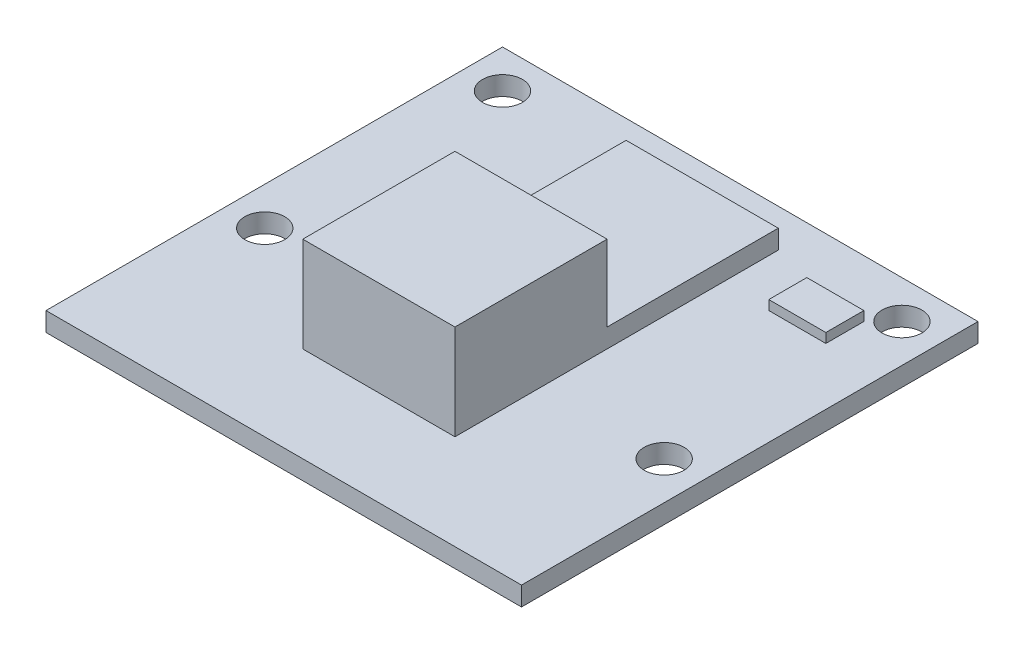
ISO-10303-21;
HEADER;
FILE_DESCRIPTION(('STEP AP214'),'2;1');
FILE_NAME('part.step','',(''),(''),'','','');
FILE_SCHEMA(('AUTOMOTIVE_DESIGN { 1 0 10303 214 1 1 1 1 }'));
ENDSEC;
DATA;
#1=APPLICATION_CONTEXT('core data for automotive mechanical design processes');
#2=APPLICATION_PROTOCOL_DEFINITION('international standard','automotive_design',2000,#1);
#3=PRODUCT_CONTEXT('',#1,'mechanical');
#4=PRODUCT('Part','Part','',(#3));
#5=PRODUCT_RELATED_PRODUCT_CATEGORY('part','',(#4));
#6=PRODUCT_DEFINITION_FORMATION('','',#4);
#7=PRODUCT_DEFINITION_CONTEXT('part definition',#1,'design');
#8=PRODUCT_DEFINITION('design','',#6,#7);
#9=PRODUCT_DEFINITION_SHAPE('','',#8);
#10=(LENGTH_UNIT() NAMED_UNIT(*) SI_UNIT(.MILLI.,.METRE.));
#11=(NAMED_UNIT(*) PLANE_ANGLE_UNIT() SI_UNIT($,.RADIAN.));
#12=(NAMED_UNIT(*) SI_UNIT($,.STERADIAN.) SOLID_ANGLE_UNIT());
#13=UNCERTAINTY_MEASURE_WITH_UNIT(LENGTH_MEASURE(1.E-05),#10,'distance_accuracy_value','');
#14=(GEOMETRIC_REPRESENTATION_CONTEXT(3) GLOBAL_UNCERTAINTY_ASSIGNED_CONTEXT((#13)) GLOBAL_UNIT_ASSIGNED_CONTEXT((#10,
#11,#12)) REPRESENTATION_CONTEXT('',''));
#15=CARTESIAN_POINT('',(0.,0.,0.));
#16=DIRECTION('',(0.,0.,1.));
#17=DIRECTION('',(1.,0.,0.));
#18=AXIS2_PLACEMENT_3D('',#15,#16,#17);
#19=CARTESIAN_POINT('',(0.,1.,0.));
#20=DIRECTION('',(0.,1.,0.));
#21=DIRECTION('',(0.,0.,1.));
#22=AXIS2_PLACEMENT_3D('',#19,#20,#21);
#23=PLANE('',#22);
#24=CARTESIAN_POINT('',(-10.5,1.,2.5));
#25=DIRECTION('',(0.,1.,0.));
#26=DIRECTION('',(0.,0.,1.));
#27=AXIS2_PLACEMENT_3D('',#24,#25,#26);
#28=CIRCLE('',#27,1.04841962507792);
#29=CARTESIAN_POINT('',(-10.5,1.,3.54841962507792));
#30=VERTEX_POINT('',#29);
#31=EDGE_CURVE('E486',#30,#30,#28,.T.);
#32=ORIENTED_EDGE('',*,*,#31,.F.);
#33=EDGE_LOOP('',(#32));
#34=FACE_BOUND('',#33,.T.);
#35=CARTESIAN_POINT('',(10.5,1.,2.5));
#36=DIRECTION('',(0.,1.,0.));
#37=DIRECTION('',(0.,0.,1.));
#38=AXIS2_PLACEMENT_3D('',#35,#36,#37);
#39=CIRCLE('',#38,1.04841962507792);
#40=CARTESIAN_POINT('',(10.5,1.,3.54841962507792));
#41=VERTEX_POINT('',#40);
#42=EDGE_CURVE('E490',#41,#41,#39,.T.);
#43=ORIENTED_EDGE('',*,*,#42,.F.);
#44=EDGE_LOOP('',(#43));
#45=FACE_BOUND('',#44,.T.);
#46=CARTESIAN_POINT('',(10.5,1.,-10.));
#47=DIRECTION('',(0.,1.,0.));
#48=DIRECTION('',(0.,0.,1.));
#49=AXIS2_PLACEMENT_3D('',#46,#47,#48);
#50=CIRCLE('',#49,1.04841962507792);
#51=CARTESIAN_POINT('',(10.5,1.,-8.95158037492208));
#52=VERTEX_POINT('',#51);
#53=EDGE_CURVE('E499',#52,#52,#50,.T.);
#54=ORIENTED_EDGE('',*,*,#53,.F.);
#55=EDGE_LOOP('',(#54));
#56=FACE_BOUND('',#55,.T.);
#57=CARTESIAN_POINT('',(-10.5,1.,-10.));
#58=DIRECTION('',(0.,1.,0.));
#59=DIRECTION('',(0.,0.,1.));
#60=AXIS2_PLACEMENT_3D('',#57,#58,#59);
#61=CIRCLE('',#60,1.04841962507792);
#62=CARTESIAN_POINT('',(-10.5,1.,-8.95158037492208));
#63=VERTEX_POINT('',#62);
#64=EDGE_CURVE('E505',#63,#63,#61,.T.);
#65=ORIENTED_EDGE('',*,*,#64,.F.);
#66=EDGE_LOOP('',(#65));
#67=FACE_BOUND('',#66,.T.);
#68=DIRECTION('',(0.,0.,1.));
#69=VECTOR('',#68,1.);
#70=CARTESIAN_POINT('',(-4.,1.,-0.999999999999997));
#71=LINE('',#70,#69);
#72=CARTESIAN_POINT('',(-4.,1.,-9.99999999999999));
#73=VERTEX_POINT('',#72);
#74=CARTESIAN_POINT('',(-4.,1.,7.));
#75=VERTEX_POINT('',#74);
#76=EDGE_CURVE('E195',#73,#75,#71,.T.);
#77=ORIENTED_EDGE('',*,*,#76,.F.);
#78=DIRECTION('',(-1.,0.,0.));
#79=VECTOR('',#78,1.);
#80=CARTESIAN_POINT('',(-4.,1.,-9.99999999999999));
#81=LINE('',#80,#79);
#82=CARTESIAN_POINT('',(4.,1.,-9.99999999999999));
#83=VERTEX_POINT('',#82);
#84=EDGE_CURVE('E161',#83,#73,#81,.T.);
#85=ORIENTED_EDGE('',*,*,#84,.F.);
#86=DIRECTION('',(0.,0.,-1.));
#87=VECTOR('',#86,1.);
#88=CARTESIAN_POINT('',(4.,1.,-0.999999999999997));
#89=LINE('',#88,#87);
#90=CARTESIAN_POINT('',(4.,1.,7.));
#91=VERTEX_POINT('',#90);
#92=EDGE_CURVE('E182',#91,#83,#89,.T.);
#93=ORIENTED_EDGE('',*,*,#92,.F.);
#94=DIRECTION('',(1.,0.,0.));
#95=VECTOR('',#94,1.);
#96=CARTESIAN_POINT('',(-4.,1.,7.));
#97=LINE('',#96,#95);
#98=EDGE_CURVE('E187',#75,#91,#97,.T.);
#99=ORIENTED_EDGE('',*,*,#98,.F.);
#100=EDGE_LOOP('',(#77,#85,#93,#99));
#101=FACE_BOUND('',#100,.T.);
#102=DIRECTION('',(0.,0.,-1.));
#103=VECTOR('',#102,1.);
#104=CARTESIAN_POINT('',(12.5,1.,-12.));
#105=LINE('',#104,#103);
#106=CARTESIAN_POINT('',(12.5,1.,12.));
#107=VERTEX_POINT('',#106);
#108=CARTESIAN_POINT('',(12.5,1.,-12.));
#109=VERTEX_POINT('',#108);
#110=EDGE_CURVE('E208',#107,#109,#105,.T.);
#111=ORIENTED_EDGE('',*,*,#110,.T.);
#112=DIRECTION('',(-1.,0.,0.));
#113=VECTOR('',#112,1.);
#114=CARTESIAN_POINT('',(-12.5,1.,-12.));
#115=LINE('',#114,#113);
#116=CARTESIAN_POINT('',(-12.5,1.,-12.));
#117=VERTEX_POINT('',#116);
#118=EDGE_CURVE('E211',#109,#117,#115,.T.);
#119=ORIENTED_EDGE('',*,*,#118,.T.);
#120=DIRECTION('',(0.,0.,1.));
#121=VECTOR('',#120,1.);
#122=CARTESIAN_POINT('',(-12.5,1.,-12.));
#123=LINE('',#122,#121);
#124=CARTESIAN_POINT('',(-12.5,1.,12.));
#125=VERTEX_POINT('',#124);
#126=EDGE_CURVE('E214',#117,#125,#123,.T.);
#127=ORIENTED_EDGE('',*,*,#126,.T.);
#128=DIRECTION('',(1.,0.,0.));
#129=VECTOR('',#128,1.);
#130=CARTESIAN_POINT('',(-12.5,1.,12.));
#131=LINE('',#130,#129);
#132=EDGE_CURVE('E216',#125,#107,#131,.T.);
#133=ORIENTED_EDGE('',*,*,#132,.T.);
#134=EDGE_LOOP('',(#111,#119,#127,#133));
#135=FACE_BOUND('',#134,.T.);
#136=DIRECTION('',(1.,0.,0.));
#137=VECTOR('',#136,1.);
#138=CARTESIAN_POINT('',(6.5,1.,-7.));
#139=LINE('',#138,#137);
#140=CARTESIAN_POINT('',(6.5,1.,-7.));
#141=VERTEX_POINT('',#140);
#142=CARTESIAN_POINT('',(9.5,1.,-7.));
#143=VERTEX_POINT('',#142);
#144=EDGE_CURVE('E515',#141,#143,#139,.T.);
#145=ORIENTED_EDGE('',*,*,#144,.F.);
#146=DIRECTION('',(0.,0.,1.));
#147=VECTOR('',#146,1.);
#148=CARTESIAN_POINT('',(6.5,1.,-9.));
#149=LINE('',#148,#147);
#150=CARTESIAN_POINT('',(6.5,1.,-9.));
#151=VERTEX_POINT('',#150);
#152=EDGE_CURVE('E159',#151,#141,#149,.T.);
#153=ORIENTED_EDGE('',*,*,#152,.F.);
#154=DIRECTION('',(-1.,0.,0.));
#155=VECTOR('',#154,1.);
#156=CARTESIAN_POINT('',(6.5,1.,-9.));
#157=LINE('',#156,#155);
#158=CARTESIAN_POINT('',(9.5,1.,-9.));
#159=VERTEX_POINT('',#158);
#160=EDGE_CURVE('E155',#159,#151,#157,.T.);
#161=ORIENTED_EDGE('',*,*,#160,.F.);
#162=DIRECTION('',(0.,0.,-1.));
#163=VECTOR('',#162,1.);
#164=CARTESIAN_POINT('',(9.5,1.,-9.));
#165=LINE('',#164,#163);
#166=EDGE_CURVE('E517',#143,#159,#165,.T.);
#167=ORIENTED_EDGE('',*,*,#166,.F.);
#168=EDGE_LOOP('',(#145,#153,#161,#167));
#169=FACE_BOUND('',#168,.T.);
#170=ADVANCED_FACE('F34',(#34,#45,#56,#67,#101,#135,#169),#23,.T.);
#171=CARTESIAN_POINT('',(-4.,6.,-0.999999999999997));
#172=DIRECTION('',(0.,0.,1.));
#173=DIRECTION('',(1.,0.,0.));
#174=AXIS2_PLACEMENT_3D('',#171,#172,#173);
#175=PLANE('',#174);
#176=DIRECTION('',(1.,0.,0.));
#177=VECTOR('',#176,1.);
#178=CARTESIAN_POINT('',(-4.,2.,-0.999999999999997));
#179=LINE('',#178,#177);
#180=CARTESIAN_POINT('',(-4.,2.,-0.999999999999997));
#181=VERTEX_POINT('',#180);
#182=CARTESIAN_POINT('',(4.,2.,-0.999999999999997));
#183=VERTEX_POINT('',#182);
#184=EDGE_CURVE('E170',#181,#183,#179,.T.);
#185=ORIENTED_EDGE('',*,*,#184,.F.);
#186=DIRECTION('',(0.,-1.,0.));
#187=VECTOR('',#186,1.);
#188=CARTESIAN_POINT('',(-4.,6.,-0.999999999999997));
#189=LINE('',#188,#187);
#190=CARTESIAN_POINT('',(-4.,6.,-0.999999999999997));
#191=VERTEX_POINT('',#190);
#192=EDGE_CURVE('E201',#191,#181,#189,.T.);
#193=ORIENTED_EDGE('',*,*,#192,.F.);
#194=DIRECTION('',(-1.,0.,0.));
#195=VECTOR('',#194,1.);
#196=CARTESIAN_POINT('',(-4.,6.,-0.999999999999997));
#197=LINE('',#196,#195);
#198=CARTESIAN_POINT('',(4.,6.,-0.999999999999997));
#199=VERTEX_POINT('',#198);
#200=EDGE_CURVE('E186',#199,#191,#197,.T.);
#201=ORIENTED_EDGE('',*,*,#200,.F.);
#202=DIRECTION('',(0.,-1.,0.));
#203=VECTOR('',#202,1.);
#204=CARTESIAN_POINT('',(4.,6.,-0.999999999999997));
#205=LINE('',#204,#203);
#206=EDGE_CURVE('E204',#199,#183,#205,.T.);
#207=ORIENTED_EDGE('',*,*,#206,.T.);
#208=EDGE_LOOP('',(#185,#193,#201,#207));
#209=FACE_BOUND('',#208,.T.);
#210=ADVANCED_FACE('F258',(#209),#175,.F.);
#211=CARTESIAN_POINT('',(12.5,1.,-12.));
#212=DIRECTION('',(-1.,0.,0.));
#213=DIRECTION('',(0.,0.,1.));
#214=AXIS2_PLACEMENT_3D('',#211,#212,#213);
#215=PLANE('',#214);
#216=DIRECTION('',(0.,0.,-1.));
#217=VECTOR('',#216,1.);
#218=CARTESIAN_POINT('',(12.5,0.,-12.));
#219=LINE('',#218,#217);
#220=CARTESIAN_POINT('',(12.5,0.,12.));
#221=VERTEX_POINT('',#220);
#222=CARTESIAN_POINT('',(12.5,0.,-12.));
#223=VERTEX_POINT('',#222);
#224=EDGE_CURVE('E207',#221,#223,#219,.T.);
#225=ORIENTED_EDGE('',*,*,#224,.T.);
#226=DIRECTION('',(0.,-1.,0.));
#227=VECTOR('',#226,1.);
#228=CARTESIAN_POINT('',(12.5,1.,-12.));
#229=LINE('',#228,#227);
#230=EDGE_CURVE('E11',#109,#223,#229,.T.);
#231=ORIENTED_EDGE('',*,*,#230,.F.);
#232=ORIENTED_EDGE('',*,*,#110,.F.);
#233=DIRECTION('',(0.,-1.,0.));
#234=VECTOR('',#233,1.);
#235=CARTESIAN_POINT('',(12.5,1.,12.));
#236=LINE('',#235,#234);
#237=EDGE_CURVE('E218',#107,#221,#236,.T.);
#238=ORIENTED_EDGE('',*,*,#237,.T.);
#239=EDGE_LOOP('',(#225,#231,#232,#238));
#240=FACE_BOUND('',#239,.T.);
#241=ADVANCED_FACE('F36',(#240),#215,.F.);
#242=CARTESIAN_POINT('',(-12.5,1.,-12.));
#243=DIRECTION('',(0.,0.,1.));
#244=DIRECTION('',(1.,0.,0.));
#245=AXIS2_PLACEMENT_3D('',#242,#243,#244);
#246=PLANE('',#245);
#247=DIRECTION('',(-1.,0.,0.));
#248=VECTOR('',#247,1.);
#249=CARTESIAN_POINT('',(-12.5,0.,-12.));
#250=LINE('',#249,#248);
#251=CARTESIAN_POINT('',(-12.5,0.,-12.));
#252=VERTEX_POINT('',#251);
#253=EDGE_CURVE('E221',#223,#252,#250,.T.);
#254=ORIENTED_EDGE('',*,*,#253,.T.);
#255=DIRECTION('',(0.,-1.,0.));
#256=VECTOR('',#255,1.);
#257=CARTESIAN_POINT('',(-12.5,1.,-12.));
#258=LINE('',#257,#256);
#259=EDGE_CURVE('E42',#117,#252,#258,.T.);
#260=ORIENTED_EDGE('',*,*,#259,.F.);
#261=ORIENTED_EDGE('',*,*,#118,.F.);
#262=ORIENTED_EDGE('',*,*,#230,.T.);
#263=EDGE_LOOP('',(#254,#260,#261,#262));
#264=FACE_BOUND('',#263,.T.);
#265=ADVANCED_FACE('F251',(#264),#246,.F.);
#266=CARTESIAN_POINT('',(-12.5,1.,-12.));
#267=DIRECTION('',(1.,0.,0.));
#268=DIRECTION('',(0.,0.,-1.));
#269=AXIS2_PLACEMENT_3D('',#266,#267,#268);
#270=PLANE('',#269);
#271=DIRECTION('',(0.,0.,1.));
#272=VECTOR('',#271,1.);
#273=CARTESIAN_POINT('',(-12.5,0.,-12.));
#274=LINE('',#273,#272);
#275=CARTESIAN_POINT('',(-12.5,0.,12.));
#276=VERTEX_POINT('',#275);
#277=EDGE_CURVE('E223',#252,#276,#274,.T.);
#278=ORIENTED_EDGE('',*,*,#277,.T.);
#279=DIRECTION('',(0.,-1.,0.));
#280=VECTOR('',#279,1.);
#281=CARTESIAN_POINT('',(-12.5,1.,12.));
#282=LINE('',#281,#280);
#283=EDGE_CURVE('E228',#125,#276,#282,.T.);
#284=ORIENTED_EDGE('',*,*,#283,.F.);
#285=ORIENTED_EDGE('',*,*,#126,.F.);
#286=ORIENTED_EDGE('',*,*,#259,.T.);
#287=EDGE_LOOP('',(#278,#284,#285,#286));
#288=FACE_BOUND('',#287,.T.);
#289=ADVANCED_FACE('F235',(#288),#270,.F.);
#290=CARTESIAN_POINT('',(-12.5,1.,12.));
#291=DIRECTION('',(0.,0.,-1.));
#292=DIRECTION('',(-1.,0.,0.));
#293=AXIS2_PLACEMENT_3D('',#290,#291,#292);
#294=PLANE('',#293);
#295=DIRECTION('',(1.,0.,0.));
#296=VECTOR('',#295,1.);
#297=CARTESIAN_POINT('',(-12.5,0.,12.));
#298=LINE('',#297,#296);
#299=EDGE_CURVE('E212',#276,#221,#298,.T.);
#300=ORIENTED_EDGE('',*,*,#299,.T.);
#301=ORIENTED_EDGE('',*,*,#237,.F.);
#302=ORIENTED_EDGE('',*,*,#132,.F.);
#303=ORIENTED_EDGE('',*,*,#283,.T.);
#304=EDGE_LOOP('',(#300,#301,#302,#303));
#305=FACE_BOUND('',#304,.T.);
#306=ADVANCED_FACE('F244',(#305),#294,.F.);
#307=CARTESIAN_POINT('',(0.,0.,0.));
#308=DIRECTION('',(0.,1.,0.));
#309=DIRECTION('',(0.,0.,1.));
#310=AXIS2_PLACEMENT_3D('',#307,#308,#309);
#311=PLANE('',#310);
#312=CARTESIAN_POINT('',(-10.5,0.,2.5));
#313=DIRECTION('',(0.,1.,0.));
#314=DIRECTION('',(0.,0.,1.));
#315=AXIS2_PLACEMENT_3D('',#312,#313,#314);
#316=CIRCLE('',#315,1.04841962507792);
#317=CARTESIAN_POINT('',(-10.5,0.,3.54841962507792));
#318=VERTEX_POINT('',#317);
#319=EDGE_CURVE('E489',#318,#318,#316,.F.);
#320=ORIENTED_EDGE('',*,*,#319,.F.);
#321=EDGE_LOOP('',(#320));
#322=FACE_BOUND('',#321,.T.);
#323=CARTESIAN_POINT('',(10.5,0.,2.5));
#324=DIRECTION('',(0.,1.,0.));
#325=DIRECTION('',(0.,0.,1.));
#326=AXIS2_PLACEMENT_3D('',#323,#324,#325);
#327=CIRCLE('',#326,1.04841962507792);
#328=CARTESIAN_POINT('',(10.5,0.,3.54841962507792));
#329=VERTEX_POINT('',#328);
#330=EDGE_CURVE('E493',#329,#329,#327,.F.);
#331=ORIENTED_EDGE('',*,*,#330,.F.);
#332=EDGE_LOOP('',(#331));
#333=FACE_BOUND('',#332,.T.);
#334=CARTESIAN_POINT('',(10.5,0.,-10.));
#335=DIRECTION('',(0.,1.,0.));
#336=DIRECTION('',(0.,0.,1.));
#337=AXIS2_PLACEMENT_3D('',#334,#335,#336);
#338=CIRCLE('',#337,1.04841962507792);
#339=CARTESIAN_POINT('',(10.5,0.,-8.95158037492208));
#340=VERTEX_POINT('',#339);
#341=EDGE_CURVE('E502',#340,#340,#338,.F.);
#342=ORIENTED_EDGE('',*,*,#341,.F.);
#343=EDGE_LOOP('',(#342));
#344=FACE_BOUND('',#343,.T.);
#345=CARTESIAN_POINT('',(-10.5,0.,-10.));
#346=DIRECTION('',(0.,1.,0.));
#347=DIRECTION('',(0.,0.,1.));
#348=AXIS2_PLACEMENT_3D('',#345,#346,#347);
#349=CIRCLE('',#348,1.04841962507792);
#350=CARTESIAN_POINT('',(-10.5,0.,-8.95158037492208));
#351=VERTEX_POINT('',#350);
#352=EDGE_CURVE('E508',#351,#351,#349,.F.);
#353=ORIENTED_EDGE('',*,*,#352,.F.);
#354=EDGE_LOOP('',(#353));
#355=FACE_BOUND('',#354,.T.);
#356=ORIENTED_EDGE('',*,*,#224,.F.);
#357=ORIENTED_EDGE('',*,*,#299,.F.);
#358=ORIENTED_EDGE('',*,*,#277,.F.);
#359=ORIENTED_EDGE('',*,*,#253,.F.);
#360=EDGE_LOOP('',(#356,#357,#358,#359));
#361=FACE_BOUND('',#360,.T.);
#362=ADVANCED_FACE('F241',(#322,#333,#344,#355,#361),#311,.F.);
#363=CARTESIAN_POINT('',(4.,6.,-0.999999999999997));
#364=DIRECTION('',(-1.,0.,0.));
#365=DIRECTION('',(0.,0.,1.));
#366=AXIS2_PLACEMENT_3D('',#363,#364,#365);
#367=PLANE('',#366);
#368=ORIENTED_EDGE('',*,*,#92,.T.);
#369=DIRECTION('',(0.,-1.,0.));
#370=VECTOR('',#369,1.);
#371=CARTESIAN_POINT('',(4.,2.,-9.99999999999999));
#372=LINE('',#371,#370);
#373=CARTESIAN_POINT('',(4.,2.,-9.99999999999999));
#374=VERTEX_POINT('',#373);
#375=EDGE_CURVE('E179',#374,#83,#372,.T.);
#376=ORIENTED_EDGE('',*,*,#375,.F.);
#377=DIRECTION('',(0.,0.,-1.));
#378=VECTOR('',#377,1.);
#379=CARTESIAN_POINT('',(4.,2.,-0.999999999999997));
#380=LINE('',#379,#378);
#381=EDGE_CURVE('E172',#183,#374,#380,.T.);
#382=ORIENTED_EDGE('',*,*,#381,.F.);
#383=ORIENTED_EDGE('',*,*,#206,.F.);
#384=DIRECTION('',(0.,0.,-1.));
#385=VECTOR('',#384,1.);
#386=CARTESIAN_POINT('',(4.,6.,-0.999999999999997));
#387=LINE('',#386,#385);
#388=CARTESIAN_POINT('',(4.,6.,7.));
#389=VERTEX_POINT('',#388);
#390=EDGE_CURVE('E183',#389,#199,#387,.T.);
#391=ORIENTED_EDGE('',*,*,#390,.F.);
#392=DIRECTION('',(0.,-1.,0.));
#393=VECTOR('',#392,1.);
#394=CARTESIAN_POINT('',(4.,6.,7.));
#395=LINE('',#394,#393);
#396=EDGE_CURVE('E193',#389,#91,#395,.T.);
#397=ORIENTED_EDGE('',*,*,#396,.T.);
#398=EDGE_LOOP('',(#368,#376,#382,#383,#391,#397));
#399=FACE_BOUND('',#398,.T.);
#400=ADVANCED_FACE('F271',(#399),#367,.F.);
#401=CARTESIAN_POINT('',(-4.,6.,-0.999999999999997));
#402=DIRECTION('',(1.,0.,0.));
#403=DIRECTION('',(0.,0.,-1.));
#404=AXIS2_PLACEMENT_3D('',#401,#402,#403);
#405=PLANE('',#404);
#406=ORIENTED_EDGE('',*,*,#76,.T.);
#407=DIRECTION('',(0.,-1.,0.));
#408=VECTOR('',#407,1.);
#409=CARTESIAN_POINT('',(-4.,6.,7.));
#410=LINE('',#409,#408);
#411=CARTESIAN_POINT('',(-4.,6.,7.));
#412=VERTEX_POINT('',#411);
#413=EDGE_CURVE('E57',#412,#75,#410,.T.);
#414=ORIENTED_EDGE('',*,*,#413,.F.);
#415=DIRECTION('',(0.,0.,1.));
#416=VECTOR('',#415,1.);
#417=CARTESIAN_POINT('',(-4.,6.,-0.999999999999997));
#418=LINE('',#417,#416);
#419=EDGE_CURVE('E189',#191,#412,#418,.T.);
#420=ORIENTED_EDGE('',*,*,#419,.F.);
#421=ORIENTED_EDGE('',*,*,#192,.T.);
#422=DIRECTION('',(0.,0.,1.));
#423=VECTOR('',#422,1.);
#424=CARTESIAN_POINT('',(-4.,2.,-0.999999999999997));
#425=LINE('',#424,#423);
#426=CARTESIAN_POINT('',(-4.,2.,-9.99999999999999));
#427=VERTEX_POINT('',#426);
#428=EDGE_CURVE('E164',#427,#181,#425,.T.);
#429=ORIENTED_EDGE('',*,*,#428,.F.);
#430=DIRECTION('',(0.,-1.,0.));
#431=VECTOR('',#430,1.);
#432=CARTESIAN_POINT('',(-4.,2.,-9.99999999999999));
#433=LINE('',#432,#431);
#434=EDGE_CURVE('E175',#427,#73,#433,.T.);
#435=ORIENTED_EDGE('',*,*,#434,.T.);
#436=EDGE_LOOP('',(#406,#414,#420,#421,#429,#435));
#437=FACE_BOUND('',#436,.T.);
#438=ADVANCED_FACE('F292',(#437),#405,.F.);
#439=CARTESIAN_POINT('',(-4.,6.,7.));
#440=DIRECTION('',(0.,0.,-1.));
#441=DIRECTION('',(-1.,0.,0.));
#442=AXIS2_PLACEMENT_3D('',#439,#440,#441);
#443=PLANE('',#442);
#444=ORIENTED_EDGE('',*,*,#98,.T.);
#445=ORIENTED_EDGE('',*,*,#396,.F.);
#446=DIRECTION('',(1.,0.,0.));
#447=VECTOR('',#446,1.);
#448=CARTESIAN_POINT('',(-4.,6.,7.));
#449=LINE('',#448,#447);
#450=EDGE_CURVE('E191',#412,#389,#449,.T.);
#451=ORIENTED_EDGE('',*,*,#450,.F.);
#452=ORIENTED_EDGE('',*,*,#413,.T.);
#453=EDGE_LOOP('',(#444,#445,#451,#452));
#454=FACE_BOUND('',#453,.T.);
#455=ADVANCED_FACE('F300',(#454),#443,.F.);
#456=CARTESIAN_POINT('',(0.,6.,0.));
#457=DIRECTION('',(0.,1.,0.));
#458=DIRECTION('',(0.,0.,1.));
#459=AXIS2_PLACEMENT_3D('',#456,#457,#458);
#460=PLANE('',#459);
#461=ORIENTED_EDGE('',*,*,#390,.T.);
#462=ORIENTED_EDGE('',*,*,#200,.T.);
#463=ORIENTED_EDGE('',*,*,#419,.T.);
#464=ORIENTED_EDGE('',*,*,#450,.T.);
#465=EDGE_LOOP('',(#461,#462,#463,#464));
#466=FACE_BOUND('',#465,.T.);
#467=ADVANCED_FACE('F309',(#466),#460,.T.);
#468=CARTESIAN_POINT('',(-4.,2.,-9.99999999999999));
#469=DIRECTION('',(0.,0.,1.));
#470=DIRECTION('',(1.,0.,0.));
#471=AXIS2_PLACEMENT_3D('',#468,#469,#470);
#472=PLANE('',#471);
#473=ORIENTED_EDGE('',*,*,#84,.T.);
#474=ORIENTED_EDGE('',*,*,#434,.F.);
#475=DIRECTION('',(-1.,0.,0.));
#476=VECTOR('',#475,1.);
#477=CARTESIAN_POINT('',(-4.,2.,-9.99999999999999));
#478=LINE('',#477,#476);
#479=EDGE_CURVE('E174',#374,#427,#478,.T.);
#480=ORIENTED_EDGE('',*,*,#479,.F.);
#481=ORIENTED_EDGE('',*,*,#375,.T.);
#482=EDGE_LOOP('',(#473,#474,#480,#481));
#483=FACE_BOUND('',#482,.T.);
#484=ADVANCED_FACE('F317',(#483),#472,.F.);
#485=CARTESIAN_POINT('',(0.,2.,0.));
#486=DIRECTION('',(0.,-1.,0.));
#487=DIRECTION('',(0.,0.,-1.));
#488=AXIS2_PLACEMENT_3D('',#485,#486,#487);
#489=PLANE('',#488);
#490=ORIENTED_EDGE('',*,*,#428,.T.);
#491=ORIENTED_EDGE('',*,*,#184,.T.);
#492=ORIENTED_EDGE('',*,*,#381,.T.);
#493=ORIENTED_EDGE('',*,*,#479,.T.);
#494=EDGE_LOOP('',(#490,#491,#492,#493));
#495=FACE_BOUND('',#494,.T.);
#496=ADVANCED_FACE('F324',(#495),#489,.F.);
#497=CARTESIAN_POINT('',(6.5,1.5,-9.));
#498=DIRECTION('',(1.,0.,0.));
#499=DIRECTION('',(0.,0.,-1.));
#500=AXIS2_PLACEMENT_3D('',#497,#498,#499);
#501=PLANE('',#500);
#502=ORIENTED_EDGE('',*,*,#152,.T.);
#503=DIRECTION('',(0.,-1.,0.));
#504=VECTOR('',#503,1.);
#505=CARTESIAN_POINT('',(6.5,1.5,-7.));
#506=LINE('',#505,#504);
#507=CARTESIAN_POINT('',(6.5,1.5,-7.));
#508=VERTEX_POINT('',#507);
#509=EDGE_CURVE('E140',#508,#141,#506,.T.);
#510=ORIENTED_EDGE('',*,*,#509,.F.);
#511=DIRECTION('',(0.,0.,1.));
#512=VECTOR('',#511,1.);
#513=CARTESIAN_POINT('',(6.5,1.5,-9.));
#514=LINE('',#513,#512);
#515=CARTESIAN_POINT('',(6.5,1.5,-9.));
#516=VERTEX_POINT('',#515);
#517=EDGE_CURVE('E147',#516,#508,#514,.T.);
#518=ORIENTED_EDGE('',*,*,#517,.F.);
#519=DIRECTION('',(0.,-1.,0.));
#520=VECTOR('',#519,1.);
#521=CARTESIAN_POINT('',(6.5,1.5,-9.));
#522=LINE('',#521,#520);
#523=EDGE_CURVE('E513',#516,#151,#522,.T.);
#524=ORIENTED_EDGE('',*,*,#523,.T.);
#525=EDGE_LOOP('',(#502,#510,#518,#524));
#526=FACE_BOUND('',#525,.T.);
#527=ADVANCED_FACE('F157',(#526),#501,.F.);
#528=CARTESIAN_POINT('',(6.5,1.5,-7.));
#529=DIRECTION('',(0.,0.,-1.));
#530=DIRECTION('',(-1.,0.,0.));
#531=AXIS2_PLACEMENT_3D('',#528,#529,#530);
#532=PLANE('',#531);
#533=ORIENTED_EDGE('',*,*,#144,.T.);
#534=DIRECTION('',(0.,-1.,0.));
#535=VECTOR('',#534,1.);
#536=CARTESIAN_POINT('',(9.5,1.5,-7.));
#537=LINE('',#536,#535);
#538=CARTESIAN_POINT('',(9.5,1.5,-7.));
#539=VERTEX_POINT('',#538);
#540=EDGE_CURVE('E143',#539,#143,#537,.T.);
#541=ORIENTED_EDGE('',*,*,#540,.F.);
#542=DIRECTION('',(1.,0.,0.));
#543=VECTOR('',#542,1.);
#544=CARTESIAN_POINT('',(6.5,1.5,-7.));
#545=LINE('',#544,#543);
#546=EDGE_CURVE('E136',#508,#539,#545,.T.);
#547=ORIENTED_EDGE('',*,*,#546,.F.);
#548=ORIENTED_EDGE('',*,*,#509,.T.);
#549=EDGE_LOOP('',(#533,#541,#547,#548));
#550=FACE_BOUND('',#549,.T.);
#551=ADVANCED_FACE('F138',(#550),#532,.F.);
#552=CARTESIAN_POINT('',(9.5,1.5,-9.));
#553=DIRECTION('',(-1.,0.,0.));
#554=DIRECTION('',(0.,0.,1.));
#555=AXIS2_PLACEMENT_3D('',#552,#553,#554);
#556=PLANE('',#555);
#557=ORIENTED_EDGE('',*,*,#166,.T.);
#558=DIRECTION('',(0.,-1.,0.));
#559=VECTOR('',#558,1.);
#560=CARTESIAN_POINT('',(9.5,1.5,-9.));
#561=LINE('',#560,#559);
#562=CARTESIAN_POINT('',(9.5,1.5,-9.));
#563=VERTEX_POINT('',#562);
#564=EDGE_CURVE('E49',#563,#159,#561,.T.);
#565=ORIENTED_EDGE('',*,*,#564,.F.);
#566=DIRECTION('',(0.,0.,-1.));
#567=VECTOR('',#566,1.);
#568=CARTESIAN_POINT('',(9.5,1.5,-9.));
#569=LINE('',#568,#567);
#570=EDGE_CURVE('E146',#539,#563,#569,.T.);
#571=ORIENTED_EDGE('',*,*,#570,.F.);
#572=ORIENTED_EDGE('',*,*,#540,.T.);
#573=EDGE_LOOP('',(#557,#565,#571,#572));
#574=FACE_BOUND('',#573,.T.);
#575=ADVANCED_FACE('F345',(#574),#556,.F.);
#576=CARTESIAN_POINT('',(6.5,1.5,-9.));
#577=DIRECTION('',(0.,0.,1.));
#578=DIRECTION('',(1.,0.,0.));
#579=AXIS2_PLACEMENT_3D('',#576,#577,#578);
#580=PLANE('',#579);
#581=ORIENTED_EDGE('',*,*,#160,.T.);
#582=ORIENTED_EDGE('',*,*,#523,.F.);
#583=DIRECTION('',(-1.,0.,0.));
#584=VECTOR('',#583,1.);
#585=CARTESIAN_POINT('',(6.5,1.5,-9.));
#586=LINE('',#585,#584);
#587=EDGE_CURVE('E151',#563,#516,#586,.T.);
#588=ORIENTED_EDGE('',*,*,#587,.F.);
#589=ORIENTED_EDGE('',*,*,#564,.T.);
#590=EDGE_LOOP('',(#581,#582,#588,#589));
#591=FACE_BOUND('',#590,.T.);
#592=ADVANCED_FACE('F351',(#591),#580,.F.);
#593=CARTESIAN_POINT('',(0.,1.5,0.));
#594=DIRECTION('',(0.,1.,0.));
#595=DIRECTION('',(0.,0.,1.));
#596=AXIS2_PLACEMENT_3D('',#593,#594,#595);
#597=PLANE('',#596);
#598=ORIENTED_EDGE('',*,*,#517,.T.);
#599=ORIENTED_EDGE('',*,*,#546,.T.);
#600=ORIENTED_EDGE('',*,*,#570,.T.);
#601=ORIENTED_EDGE('',*,*,#587,.T.);
#602=EDGE_LOOP('',(#598,#599,#600,#601));
#603=FACE_BOUND('',#602,.T.);
#604=ADVANCED_FACE('F150',(#603),#597,.T.);
#605=CARTESIAN_POINT('',(-10.5,-0.000999999999999916,-10.));
#606=DIRECTION('',(0.,1.,0.));
#607=DIRECTION('',(0.,0.,1.));
#608=AXIS2_PLACEMENT_3D('',#605,#606,#607);
#609=CYLINDRICAL_SURFACE('',#608,1.04841962507792);
#610=ORIENTED_EDGE('',*,*,#64,.T.);
#611=EDGE_LOOP('',(#610));
#612=FACE_BOUND('',#611,.T.);
#613=ORIENTED_EDGE('',*,*,#352,.T.);
#614=EDGE_LOOP('',(#613));
#615=FACE_BOUND('',#614,.T.);
#616=ADVANCED_FACE('F364',(#612,#615),#609,.F.);
#617=CARTESIAN_POINT('',(10.5,-0.000999999999999916,-10.));
#618=DIRECTION('',(0.,1.,0.));
#619=DIRECTION('',(0.,0.,1.));
#620=AXIS2_PLACEMENT_3D('',#617,#618,#619);
#621=CYLINDRICAL_SURFACE('',#620,1.04841962507792);
#622=ORIENTED_EDGE('',*,*,#53,.T.);
#623=EDGE_LOOP('',(#622));
#624=FACE_BOUND('',#623,.T.);
#625=ORIENTED_EDGE('',*,*,#341,.T.);
#626=EDGE_LOOP('',(#625));
#627=FACE_BOUND('',#626,.T.);
#628=ADVANCED_FACE('F370',(#624,#627),#621,.F.);
#629=CARTESIAN_POINT('',(10.5,-0.000999999999999916,2.5));
#630=DIRECTION('',(0.,1.,0.));
#631=DIRECTION('',(0.,0.,1.));
#632=AXIS2_PLACEMENT_3D('',#629,#630,#631);
#633=CYLINDRICAL_SURFACE('',#632,1.04841962507792);
#634=ORIENTED_EDGE('',*,*,#42,.T.);
#635=EDGE_LOOP('',(#634));
#636=FACE_BOUND('',#635,.T.);
#637=ORIENTED_EDGE('',*,*,#330,.T.);
#638=EDGE_LOOP('',(#637));
#639=FACE_BOUND('',#638,.T.);
#640=ADVANCED_FACE('F378',(#636,#639),#633,.F.);
#641=CARTESIAN_POINT('',(-10.5,-0.000999999999999916,2.5));
#642=DIRECTION('',(0.,1.,0.));
#643=DIRECTION('',(0.,0.,1.));
#644=AXIS2_PLACEMENT_3D('',#641,#642,#643);
#645=CYLINDRICAL_SURFACE('',#644,1.04841962507792);
#646=ORIENTED_EDGE('',*,*,#31,.T.);
#647=EDGE_LOOP('',(#646));
#648=FACE_BOUND('',#647,.T.);
#649=ORIENTED_EDGE('',*,*,#319,.T.);
#650=EDGE_LOOP('',(#649));
#651=FACE_BOUND('',#650,.T.);
#652=ADVANCED_FACE('F386',(#648,#651),#645,.F.);
#653=CLOSED_SHELL('',(#170,#210,#241,#265,#289,#306,#362,#400,#438,#455,#467,#484,#496,#527,
#551,#575,#592,#604,#616,#628,#640,#652));
#654=MANIFOLD_SOLID_BREP('B2',#653);
#655=ADVANCED_BREP_SHAPE_REPRESENTATION('',(#18,#654),#14);
#656=SHAPE_DEFINITION_REPRESENTATION(#9,#655);
ENDSEC;
END-ISO-10303-21;
